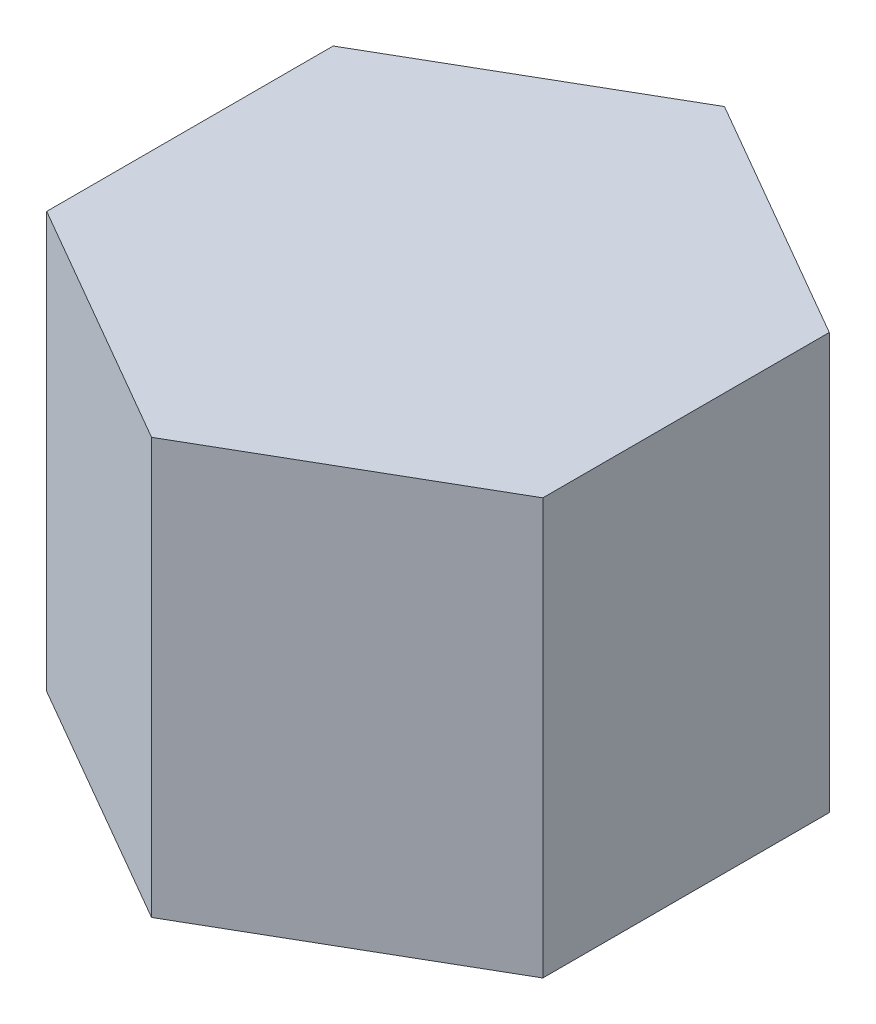
ISO-10303-21;
HEADER;
FILE_DESCRIPTION(('STEP AP214'),'2;1');
FILE_NAME('part.step','',(''),(''),'','','');
FILE_SCHEMA(('AUTOMOTIVE_DESIGN { 1 0 10303 214 1 1 1 1 }'));
ENDSEC;
DATA;
#1=APPLICATION_CONTEXT('core data for automotive mechanical design processes');
#2=APPLICATION_PROTOCOL_DEFINITION('international standard','automotive_design',2000,#1);
#3=PRODUCT_CONTEXT('',#1,'mechanical');
#4=PRODUCT('Part','Part','',(#3));
#5=PRODUCT_RELATED_PRODUCT_CATEGORY('part','',(#4));
#6=PRODUCT_DEFINITION_FORMATION('','',#4);
#7=PRODUCT_DEFINITION_CONTEXT('part definition',#1,'design');
#8=PRODUCT_DEFINITION('design','',#6,#7);
#9=PRODUCT_DEFINITION_SHAPE('','',#8);
#10=(LENGTH_UNIT() NAMED_UNIT(*) SI_UNIT(.MILLI.,.METRE.));
#11=(NAMED_UNIT(*) PLANE_ANGLE_UNIT() SI_UNIT($,.RADIAN.));
#12=(NAMED_UNIT(*) SI_UNIT($,.STERADIAN.) SOLID_ANGLE_UNIT());
#13=UNCERTAINTY_MEASURE_WITH_UNIT(LENGTH_MEASURE(1.E-05),#10,'distance_accuracy_value','');
#14=(GEOMETRIC_REPRESENTATION_CONTEXT(3) GLOBAL_UNCERTAINTY_ASSIGNED_CONTEXT((#13)) GLOBAL_UNIT_ASSIGNED_CONTEXT((#10,
#11,#12)) REPRESENTATION_CONTEXT('',''));
#15=CARTESIAN_POINT('',(0.,0.,0.));
#16=DIRECTION('',(0.,0.,1.));
#17=DIRECTION('',(1.,0.,0.));
#18=AXIS2_PLACEMENT_3D('',#15,#16,#17);
#19=CARTESIAN_POINT('',(206.142660308706,-148.537700895744,287.176844201572));
#20=DIRECTION('',(-0.499999999999943,0.,-0.866025403784472));
#21=DIRECTION('',(-0.866025403784472,0.,0.499999999999943));
#22=AXIS2_PLACEMENT_3D('',#19,#20,#21);
#23=PLANE('',#22);
#24=CARTESIAN_POINT('',(205.839551417382,-149.045793579175,287.351844201572));
#25=DIRECTION('',(0.866025403784471,0.,-0.499999999999943));
#26=VECTOR('',#25,1.);
#27=LINE('',#24,#26);
#28=CARTESIAN_POINT('',(205.839551417382,-149.045793579175,287.351844201572));
#29=VERTEX_POINT('',#28);
#30=CARTESIAN_POINT('',(206.142660308706,-149.045793579175,287.176844201572));
#31=VERTEX_POINT('',#30);
#32=EDGE_CURVE('E170',#29,#31,#27,.T.);
#33=ORIENTED_EDGE('',*,*,#32,.T.);
#34=CARTESIAN_POINT('',(206.142660308706,-148.537700895744,287.176844201572));
#35=DIRECTION('',(0.,-1.,0.));
#36=VECTOR('',#35,1.);
#37=LINE('',#34,#36);
#38=CARTESIAN_POINT('',(206.142660308706,-148.537700895744,287.176844201572));
#39=VERTEX_POINT('',#38);
#40=EDGE_CURVE('E35',#39,#31,#37,.T.);
#41=ORIENTED_EDGE('',*,*,#40,.F.);
#42=CARTESIAN_POINT('',(205.839551417382,-148.537700895744,287.351844201572));
#43=DIRECTION('',(0.866025403784471,0.,-0.499999999999943));
#44=VECTOR('',#43,1.);
#45=LINE('',#42,#44);
#46=CARTESIAN_POINT('',(205.839551417382,-148.537700895744,287.351844201572));
#47=VERTEX_POINT('',#46);
#48=EDGE_CURVE('E159',#47,#39,#45,.T.);
#49=ORIENTED_EDGE('',*,*,#48,.F.);
#50=CARTESIAN_POINT('',(205.839551417382,-148.537700895744,287.351844201572));
#51=DIRECTION('',(0.,-1.,0.));
#52=VECTOR('',#51,1.);
#53=LINE('',#50,#52);
#54=EDGE_CURVE('E10',#47,#29,#53,.T.);
#55=ORIENTED_EDGE('',*,*,#54,.T.);
#56=EDGE_LOOP('',(#33,#41,#49,#55));
#57=FACE_BOUND('',#56,.T.);
#58=ADVANCED_FACE('F16',(#57),#23,.F.);
#59=CARTESIAN_POINT('',(205.839551417382,-148.537700895744,287.351844201572));
#60=DIRECTION('',(0.499999999999978,0.,-0.866025403784452));
#61=DIRECTION('',(-0.866025403784452,0.,-0.499999999999978));
#62=AXIS2_PLACEMENT_3D('',#59,#60,#61);
#63=PLANE('',#62);
#64=CARTESIAN_POINT('',(205.536442526057,-149.045793579175,287.176844201572));
#65=DIRECTION('',(0.866025403784452,0.,0.499999999999978));
#66=VECTOR('',#65,1.);
#67=LINE('',#64,#66);
#68=CARTESIAN_POINT('',(205.536442526057,-149.045793579175,287.176844201572));
#69=VERTEX_POINT('',#68);
#70=EDGE_CURVE('E167',#69,#29,#67,.T.);
#71=ORIENTED_EDGE('',*,*,#70,.T.);
#72=ORIENTED_EDGE('',*,*,#54,.F.);
#73=CARTESIAN_POINT('',(205.536442526057,-148.537700895744,287.176844201572));
#74=DIRECTION('',(0.866025403784452,0.,0.499999999999978));
#75=VECTOR('',#74,1.);
#76=LINE('',#73,#75);
#77=CARTESIAN_POINT('',(205.536442526057,-148.537700895744,287.176844201572));
#78=VERTEX_POINT('',#77);
#79=EDGE_CURVE('E156',#78,#47,#76,.T.);
#80=ORIENTED_EDGE('',*,*,#79,.F.);
#81=CARTESIAN_POINT('',(205.536442526057,-148.537700895744,287.176844201572));
#82=DIRECTION('',(0.,-1.,0.));
#83=VECTOR('',#82,1.);
#84=LINE('',#81,#83);
#85=EDGE_CURVE('E27',#78,#69,#84,.T.);
#86=ORIENTED_EDGE('',*,*,#85,.T.);
#87=EDGE_LOOP('',(#71,#72,#80,#86));
#88=FACE_BOUND('',#87,.T.);
#89=ADVANCED_FACE('F189',(#88),#63,.F.);
#90=CARTESIAN_POINT('',(205.536442526057,-148.537700895744,290.831971220494));
#91=DIRECTION('',(1.,0.,0.));
#92=DIRECTION('',(0.,1.,0.));
#93=AXIS2_PLACEMENT_3D('',#90,#91,#92);
#94=PLANE('',#93);
#95=CARTESIAN_POINT('',(205.536442526057,-149.045793579175,286.826844201572));
#96=DIRECTION('',(0.,0.,1.));
#97=VECTOR('',#96,1.);
#98=LINE('',#95,#97);
#99=CARTESIAN_POINT('',(205.536442526057,-149.045793579175,286.826844201572));
#100=VERTEX_POINT('',#99);
#101=EDGE_CURVE('E163',#100,#69,#98,.T.);
#102=ORIENTED_EDGE('',*,*,#101,.T.);
#103=ORIENTED_EDGE('',*,*,#85,.F.);
#104=CARTESIAN_POINT('',(205.536442526057,-148.537700895744,286.826844201572));
#105=DIRECTION('',(0.,0.,1.));
#106=VECTOR('',#105,1.);
#107=LINE('',#104,#106);
#108=CARTESIAN_POINT('',(205.536442526057,-148.537700895744,286.826844201572));
#109=VERTEX_POINT('',#108);
#110=EDGE_CURVE('E106',#109,#78,#107,.T.);
#111=ORIENTED_EDGE('',*,*,#110,.F.);
#112=CARTESIAN_POINT('',(205.536442526057,-148.537700895744,286.826844201572));
#113=DIRECTION('',(0.,-1.,0.));
#114=VECTOR('',#113,1.);
#115=LINE('',#112,#114);
#116=EDGE_CURVE('E94',#109,#100,#115,.T.);
#117=ORIENTED_EDGE('',*,*,#116,.T.);
#118=EDGE_LOOP('',(#102,#103,#111,#117));
#119=FACE_BOUND('',#118,.T.);
#120=ADVANCED_FACE('F198',(#119),#94,.F.);
#121=CARTESIAN_POINT('',(205.536442526057,-148.537700895744,286.826844201572));
#122=DIRECTION('',(0.499999999999978,0.,0.866025403784452));
#123=DIRECTION('',(0.866025403784452,0.,-0.499999999999978));
#124=AXIS2_PLACEMENT_3D('',#121,#122,#123);
#125=PLANE('',#124);
#126=CARTESIAN_POINT('',(205.839551417382,-149.045793579175,286.651844201572));
#127=DIRECTION('',(-0.866025403784452,0.,0.499999999999978));
#128=VECTOR('',#127,1.);
#129=LINE('',#126,#128);
#130=CARTESIAN_POINT('',(205.839551417382,-149.045793579175,286.651844201572));
#131=VERTEX_POINT('',#130);
#132=EDGE_CURVE('E162',#131,#100,#129,.T.);
#133=ORIENTED_EDGE('',*,*,#132,.T.);
#134=ORIENTED_EDGE('',*,*,#116,.F.);
#135=CARTESIAN_POINT('',(205.839551417382,-148.537700895744,286.651844201572));
#136=DIRECTION('',(-0.866025403784452,0.,0.499999999999978));
#137=VECTOR('',#136,1.);
#138=LINE('',#135,#137);
#139=CARTESIAN_POINT('',(205.839551417382,-148.537700895744,286.651844201572));
#140=VERTEX_POINT('',#139);
#141=EDGE_CURVE('E98',#140,#109,#138,.T.);
#142=ORIENTED_EDGE('',*,*,#141,.F.);
#143=CARTESIAN_POINT('',(205.839551417382,-148.537700895744,286.651844201572));
#144=DIRECTION('',(0.,-1.,0.));
#145=VECTOR('',#144,1.);
#146=LINE('',#143,#145);
#147=EDGE_CURVE('E79',#140,#131,#146,.T.);
#148=ORIENTED_EDGE('',*,*,#147,.T.);
#149=EDGE_LOOP('',(#133,#134,#142,#148));
#150=FACE_BOUND('',#149,.T.);
#151=ADVANCED_FACE('F100',(#150),#125,.F.);
#152=CARTESIAN_POINT('',(205.839551417382,-148.537700895744,286.651844201572));
#153=DIRECTION('',(-0.499999999999978,0.,0.866025403784452));
#154=DIRECTION('',(0.866025403784452,0.,0.499999999999978));
#155=AXIS2_PLACEMENT_3D('',#152,#153,#154);
#156=PLANE('',#155);
#157=CARTESIAN_POINT('',(206.142660308706,-149.045793579175,286.826844201572));
#158=DIRECTION('',(-0.866025403784452,0.,-0.499999999999978));
#159=VECTOR('',#158,1.);
#160=LINE('',#157,#159);
#161=CARTESIAN_POINT('',(206.142660308706,-149.045793579175,286.826844201572));
#162=VERTEX_POINT('',#161);
#163=EDGE_CURVE('E88',#162,#131,#160,.T.);
#164=ORIENTED_EDGE('',*,*,#163,.T.);
#165=ORIENTED_EDGE('',*,*,#147,.F.);
#166=CARTESIAN_POINT('',(206.142660308706,-148.537700895744,286.826844201572));
#167=DIRECTION('',(-0.866025403784452,0.,-0.499999999999978));
#168=VECTOR('',#167,1.);
#169=LINE('',#166,#168);
#170=CARTESIAN_POINT('',(206.142660308706,-148.537700895744,286.826844201572));
#171=VERTEX_POINT('',#170);
#172=EDGE_CURVE('E84',#171,#140,#169,.T.);
#173=ORIENTED_EDGE('',*,*,#172,.F.);
#174=CARTESIAN_POINT('',(206.142660308706,-148.537700895744,286.826844201572));
#175=DIRECTION('',(0.,-1.,0.));
#176=VECTOR('',#175,1.);
#177=LINE('',#174,#176);
#178=EDGE_CURVE('E58',#171,#162,#177,.T.);
#179=ORIENTED_EDGE('',*,*,#178,.T.);
#180=EDGE_LOOP('',(#164,#165,#173,#179));
#181=FACE_BOUND('',#180,.T.);
#182=ADVANCED_FACE('F82',(#181),#156,.F.);
#183=CARTESIAN_POINT('',(206.142660308706,-148.537700895744,290.831971220494));
#184=DIRECTION('',(-1.,0.,0.));
#185=DIRECTION('',(0.,-1.,0.));
#186=AXIS2_PLACEMENT_3D('',#183,#184,#185);
#187=PLANE('',#186);
#188=CARTESIAN_POINT('',(206.142660308706,-149.045793579175,287.176844201572));
#189=DIRECTION('',(0.,0.,-1.));
#190=VECTOR('',#189,1.);
#191=LINE('',#188,#190);
#192=EDGE_CURVE('E160',#31,#162,#191,.T.);
#193=ORIENTED_EDGE('',*,*,#192,.T.);
#194=ORIENTED_EDGE('',*,*,#178,.F.);
#195=CARTESIAN_POINT('',(206.142660308706,-148.537700895744,287.176844201572));
#196=DIRECTION('',(0.,0.,-1.));
#197=VECTOR('',#196,1.);
#198=LINE('',#195,#197);
#199=EDGE_CURVE('E112',#39,#171,#198,.T.);
#200=ORIENTED_EDGE('',*,*,#199,.F.);
#201=ORIENTED_EDGE('',*,*,#40,.T.);
#202=EDGE_LOOP('',(#193,#194,#200,#201));
#203=FACE_BOUND('',#202,.T.);
#204=ADVANCED_FACE('F131',(#203),#187,.F.);
#205=CARTESIAN_POINT('',(206.339551417382,-148.537700895744,290.831971220494));
#206=DIRECTION('',(0.,-1.,0.));
#207=DIRECTION('',(1.,0.,0.));
#208=AXIS2_PLACEMENT_3D('',#205,#206,#207);
#209=PLANE('',#208);
#210=ORIENTED_EDGE('',*,*,#48,.T.);
#211=ORIENTED_EDGE('',*,*,#199,.T.);
#212=ORIENTED_EDGE('',*,*,#172,.T.);
#213=ORIENTED_EDGE('',*,*,#141,.T.);
#214=ORIENTED_EDGE('',*,*,#110,.T.);
#215=ORIENTED_EDGE('',*,*,#79,.T.);
#216=EDGE_LOOP('',(#210,#211,#212,#213,#214,#215));
#217=FACE_BOUND('',#216,.T.);
#218=ADVANCED_FACE('F111',(#217),#209,.F.);
#219=CARTESIAN_POINT('',(206.339551417382,-149.045793579175,290.831971220494));
#220=DIRECTION('',(0.,-1.,0.));
#221=DIRECTION('',(1.,0.,0.));
#222=AXIS2_PLACEMENT_3D('',#219,#220,#221);
#223=PLANE('',#222);
#224=ORIENTED_EDGE('',*,*,#32,.F.);
#225=ORIENTED_EDGE('',*,*,#70,.F.);
#226=ORIENTED_EDGE('',*,*,#101,.F.);
#227=ORIENTED_EDGE('',*,*,#132,.F.);
#228=ORIENTED_EDGE('',*,*,#163,.F.);
#229=ORIENTED_EDGE('',*,*,#192,.F.);
#230=EDGE_LOOP('',(#224,#225,#226,#227,#228,#229));
#231=FACE_BOUND('',#230,.T.);
#232=ADVANCED_FACE('F130',(#231),#223,.T.);
#233=CLOSED_SHELL('',(#58,#89,#120,#151,#182,#204,#218,#232));
#234=MANIFOLD_SOLID_BREP('B1',#233);
#235=ADVANCED_BREP_SHAPE_REPRESENTATION('',(#18,#234),#14);
#236=SHAPE_DEFINITION_REPRESENTATION(#9,#235);
ENDSEC;
END-ISO-10303-21;
